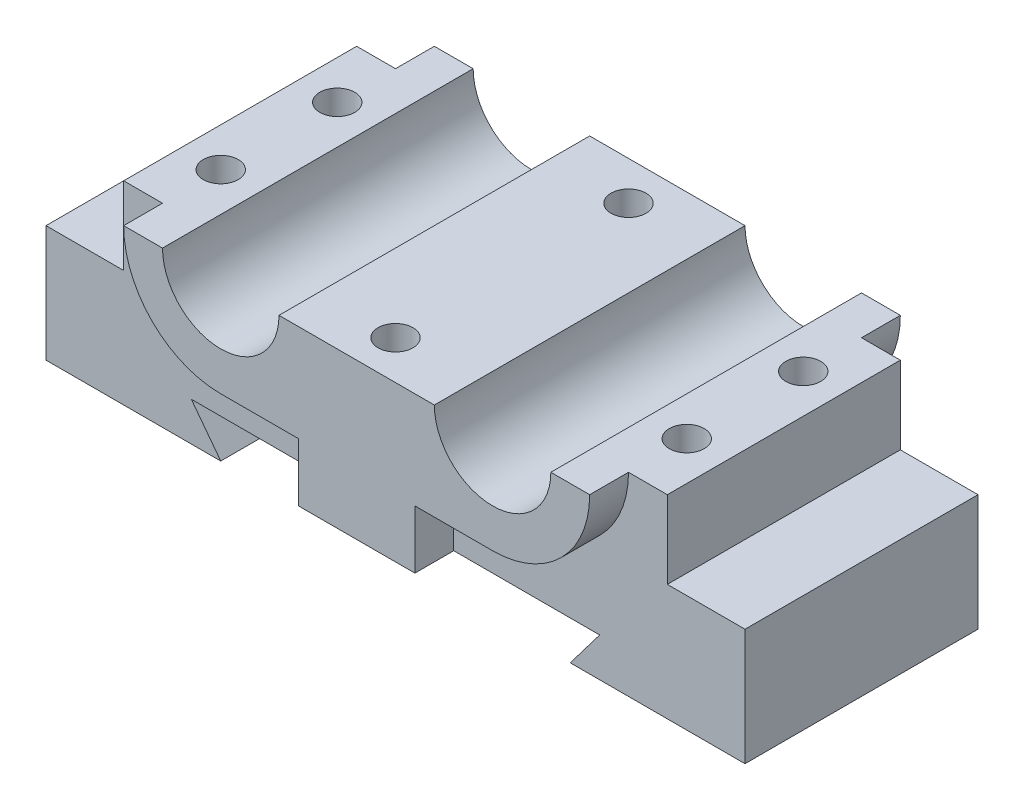
ISO-10303-21;
HEADER;
FILE_DESCRIPTION(('STEP AP214'),'2;1');
FILE_NAME('part.step','',(''),(''),'','','');
FILE_SCHEMA(('AUTOMOTIVE_DESIGN { 1 0 10303 214 1 1 1 1 }'));
ENDSEC;
DATA;
#1=APPLICATION_CONTEXT('core data for automotive mechanical design processes');
#2=APPLICATION_PROTOCOL_DEFINITION('international standard','automotive_design',2000,#1);
#3=PRODUCT_CONTEXT('',#1,'mechanical');
#4=PRODUCT('Part','Part','',(#3));
#5=PRODUCT_RELATED_PRODUCT_CATEGORY('part','',(#4));
#6=PRODUCT_DEFINITION_FORMATION('','',#4);
#7=PRODUCT_DEFINITION_CONTEXT('part definition',#1,'design');
#8=PRODUCT_DEFINITION('design','',#6,#7);
#9=PRODUCT_DEFINITION_SHAPE('','',#8);
#10=(LENGTH_UNIT() NAMED_UNIT(*) SI_UNIT(.MILLI.,.METRE.));
#11=(NAMED_UNIT(*) PLANE_ANGLE_UNIT() SI_UNIT($,.RADIAN.));
#12=(NAMED_UNIT(*) SI_UNIT($,.STERADIAN.) SOLID_ANGLE_UNIT());
#13=UNCERTAINTY_MEASURE_WITH_UNIT(LENGTH_MEASURE(1.E-05),#10,'distance_accuracy_value','');
#14=(GEOMETRIC_REPRESENTATION_CONTEXT(3) GLOBAL_UNCERTAINTY_ASSIGNED_CONTEXT((#13)) GLOBAL_UNIT_ASSIGNED_CONTEXT((#10,
#11,#12)) REPRESENTATION_CONTEXT('',''));
#15=CARTESIAN_POINT('',(0.,0.,0.));
#16=DIRECTION('',(0.,0.,1.));
#17=DIRECTION('',(1.,0.,0.));
#18=AXIS2_PLACEMENT_3D('',#15,#16,#17);
#19=CARTESIAN_POINT('',(0.,17.5,0.));
#20=DIRECTION('',(0.,-1.,0.));
#21=DIRECTION('',(0.,0.,-1.));
#22=AXIS2_PLACEMENT_3D('',#19,#20,#21);
#23=PLANE('',#22);
#24=CARTESIAN_POINT('',(30.,17.5,-7.5));
#25=DIRECTION('',(0.,1.,0.));
#26=DIRECTION('',(0.,0.,-1.));
#27=AXIS2_PLACEMENT_3D('',#24,#25,#26);
#28=CIRCLE('',#27,2.25);
#29=CARTESIAN_POINT('',(30.,17.5,-9.74999999999999));
#30=VERTEX_POINT('',#29);
#31=EDGE_CURVE('E551',#30,#30,#28,.T.);
#32=ORIENTED_EDGE('',*,*,#31,.F.);
#33=EDGE_LOOP('',(#32));
#34=FACE_BOUND('',#33,.T.);
#35=CARTESIAN_POINT('',(30.,17.5,7.5));
#36=DIRECTION('',(0.,1.,0.));
#37=DIRECTION('',(0.,0.,1.));
#38=AXIS2_PLACEMENT_3D('',#35,#36,#37);
#39=CIRCLE('',#38,2.25);
#40=CARTESIAN_POINT('',(30.,17.5,9.74999999999999));
#41=VERTEX_POINT('',#40);
#42=EDGE_CURVE('E545',#41,#41,#39,.T.);
#43=ORIENTED_EDGE('',*,*,#42,.F.);
#44=EDGE_LOOP('',(#43));
#45=FACE_BOUND('',#44,.T.);
#46=DIRECTION('',(0.,0.,1.));
#47=VECTOR('',#46,1.);
#48=CARTESIAN_POINT('',(25.,17.5,-20.));
#49=LINE('',#48,#47);
#50=CARTESIAN_POINT('',(25.,17.5,-20.));
#51=VERTEX_POINT('',#50);
#52=CARTESIAN_POINT('',(25.,17.5,20.));
#53=VERTEX_POINT('',#52);
#54=EDGE_CURVE('E349',#51,#53,#49,.T.);
#55=ORIENTED_EDGE('',*,*,#54,.T.);
#56=DIRECTION('',(-1.,0.,0.));
#57=VECTOR('',#56,1.);
#58=CARTESIAN_POINT('',(0.,17.5,20.));
#59=LINE('',#58,#57);
#60=CARTESIAN_POINT('',(30.,17.5,20.));
#61=VERTEX_POINT('',#60);
#62=EDGE_CURVE('E259',#61,#53,#59,.T.);
#63=ORIENTED_EDGE('',*,*,#62,.F.);
#64=DIRECTION('',(0.,0.,1.));
#65=VECTOR('',#64,1.);
#66=CARTESIAN_POINT('',(30.,17.5,-20.));
#67=LINE('',#66,#65);
#68=CARTESIAN_POINT('',(30.,17.5,15.));
#69=VERTEX_POINT('',#68);
#70=EDGE_CURVE('E255',#69,#61,#67,.T.);
#71=ORIENTED_EDGE('',*,*,#70,.F.);
#72=DIRECTION('',(1.,0.,0.));
#73=VECTOR('',#72,1.);
#74=CARTESIAN_POINT('',(-35.,17.5,15.));
#75=LINE('',#74,#73);
#76=CARTESIAN_POINT('',(35.,17.5,15.));
#77=VERTEX_POINT('',#76);
#78=EDGE_CURVE('E404',#69,#77,#75,.T.);
#79=ORIENTED_EDGE('',*,*,#78,.T.);
#80=DIRECTION('',(0.,0.,-1.));
#81=VECTOR('',#80,1.);
#82=CARTESIAN_POINT('',(35.,17.5,15.));
#83=LINE('',#82,#81);
#84=CARTESIAN_POINT('',(35.,17.5,-15.));
#85=VERTEX_POINT('',#84);
#86=EDGE_CURVE('E409',#77,#85,#83,.T.);
#87=ORIENTED_EDGE('',*,*,#86,.T.);
#88=DIRECTION('',(-1.,0.,0.));
#89=VECTOR('',#88,1.);
#90=CARTESIAN_POINT('',(-35.,17.5,-15.));
#91=LINE('',#90,#89);
#92=CARTESIAN_POINT('',(30.,17.5,-15.));
#93=VERTEX_POINT('',#92);
#94=EDGE_CURVE('E412',#85,#93,#91,.T.);
#95=ORIENTED_EDGE('',*,*,#94,.T.);
#96=CARTESIAN_POINT('',(30.,17.5,-20.));
#97=VERTEX_POINT('',#96);
#98=EDGE_CURVE('E56',#97,#93,#67,.T.);
#99=ORIENTED_EDGE('',*,*,#98,.F.);
#100=DIRECTION('',(-1.,0.,0.));
#101=VECTOR('',#100,1.);
#102=CARTESIAN_POINT('',(0.,17.5,-20.));
#103=LINE('',#102,#101);
#104=EDGE_CURVE('E298',#97,#51,#103,.T.);
#105=ORIENTED_EDGE('',*,*,#104,.T.);
#106=EDGE_LOOP('',(#55,#63,#71,#79,#87,#95,#99,#105));
#107=FACE_BOUND('',#106,.T.);
#108=ADVANCED_FACE('F33',(#34,#45,#107),#23,.F.);
#109=CARTESIAN_POINT('',(0.,17.5,15.));
#110=DIRECTION('',(0.,1.,0.));
#111=DIRECTION('',(0.,0.,-1.));
#112=AXIS2_PLACEMENT_3D('',#109,#110,#111);
#113=CIRCLE('',#112,2.25);
#114=CARTESIAN_POINT('',(0.,17.5,12.75));
#115=VERTEX_POINT('',#114);
#116=EDGE_CURVE('E535',#115,#115,#113,.T.);
#117=ORIENTED_EDGE('',*,*,#116,.F.);
#118=EDGE_LOOP('',(#117));
#119=FACE_BOUND('',#118,.T.);
#120=CARTESIAN_POINT('',(0.,17.5,-15.));
#121=DIRECTION('',(0.,1.,0.));
#122=DIRECTION('',(0.,0.,1.));
#123=AXIS2_PLACEMENT_3D('',#120,#121,#122);
#124=CIRCLE('',#123,2.25);
#125=CARTESIAN_POINT('',(0.,17.5,-12.75));
#126=VERTEX_POINT('',#125);
#127=EDGE_CURVE('E268',#126,#126,#124,.T.);
#128=ORIENTED_EDGE('',*,*,#127,.F.);
#129=EDGE_LOOP('',(#128));
#130=FACE_BOUND('',#129,.T.);
#131=CARTESIAN_POINT('',(10.,17.5,20.));
#132=VERTEX_POINT('',#131);
#133=CARTESIAN_POINT('',(-10.,17.5,20.));
#134=VERTEX_POINT('',#133);
#135=EDGE_CURVE('E275',#132,#134,#59,.T.);
#136=ORIENTED_EDGE('',*,*,#135,.F.);
#137=DIRECTION('',(0.,0.,1.));
#138=VECTOR('',#137,1.);
#139=CARTESIAN_POINT('',(10.,17.5,-20.));
#140=LINE('',#139,#138);
#141=CARTESIAN_POINT('',(10.,17.5,-20.));
#142=VERTEX_POINT('',#141);
#143=EDGE_CURVE('E347',#142,#132,#140,.T.);
#144=ORIENTED_EDGE('',*,*,#143,.F.);
#145=CARTESIAN_POINT('',(-10.,17.5,-20.));
#146=VERTEX_POINT('',#145);
#147=EDGE_CURVE('E303',#142,#146,#103,.T.);
#148=ORIENTED_EDGE('',*,*,#147,.T.);
#149=DIRECTION('',(0.,0.,1.));
#150=VECTOR('',#149,1.);
#151=CARTESIAN_POINT('',(-10.,17.5,-20.));
#152=LINE('',#151,#150);
#153=EDGE_CURVE('E345',#146,#134,#152,.T.);
#154=ORIENTED_EDGE('',*,*,#153,.T.);
#155=EDGE_LOOP('',(#136,#144,#148,#154));
#156=FACE_BOUND('',#155,.T.);
#157=ADVANCED_FACE('F452',(#119,#130,#156),#23,.F.);
#158=CARTESIAN_POINT('',(-45.,7.5,-15.));
#159=DIRECTION('',(0.,0.,1.));
#160=DIRECTION('',(1.,0.,0.));
#161=AXIS2_PLACEMENT_3D('',#158,#159,#160);
#162=PLANE('',#161);
#163=DIRECTION('',(0.,1.,0.));
#164=VECTOR('',#163,1.);
#165=CARTESIAN_POINT('',(-7.50000000000001,7.5,-15.));
#166=LINE('',#165,#164);
#167=CARTESIAN_POINT('',(-7.50000000000001,-2.49999999999994,-15.));
#168=VERTEX_POINT('',#167);
#169=CARTESIAN_POINT('',(-7.50000000000001,5.,-15.));
#170=VERTEX_POINT('',#169);
#171=EDGE_CURVE('E354',#168,#170,#166,.T.);
#172=ORIENTED_EDGE('',*,*,#171,.F.);
#173=DIRECTION('',(-1.,0.,0.));
#174=VECTOR('',#173,1.);
#175=CARTESIAN_POINT('',(-45.,-2.49999999999988,-15.));
#176=LINE('',#175,#174);
#177=CARTESIAN_POINT('',(-26.2867829160891,-2.49999999999991,-15.));
#178=VERTEX_POINT('',#177);
#179=EDGE_CURVE('E396',#168,#178,#176,.T.);
#180=ORIENTED_EDGE('',*,*,#179,.T.);
#181=DIRECTION('',(0.603746672382739,-0.797176238724392,0.));
#182=VECTOR('',#181,1.);
#183=CARTESIAN_POINT('',(-37.9208635207843,12.8614306160315,-15.));
#184=LINE('',#183,#182);
#185=CARTESIAN_POINT('',(-22.5,-7.49999999999992,-15.));
#186=VERTEX_POINT('',#185);
#187=EDGE_CURVE('E393',#178,#186,#184,.T.);
#188=ORIENTED_EDGE('',*,*,#187,.T.);
#189=DIRECTION('',(-1.,0.,0.));
#190=VECTOR('',#189,1.);
#191=CARTESIAN_POINT('',(-45.,-7.5,-15.));
#192=LINE('',#191,#190);
#193=CARTESIAN_POINT('',(-45.,-7.5,-15.));
#194=VERTEX_POINT('',#193);
#195=EDGE_CURVE('E665',#186,#194,#192,.T.);
#196=ORIENTED_EDGE('',*,*,#195,.T.);
#197=DIRECTION('',(0.,-1.,0.));
#198=VECTOR('',#197,1.);
#199=CARTESIAN_POINT('',(-45.,7.5,-15.));
#200=LINE('',#199,#198);
#201=CARTESIAN_POINT('',(-45.,7.5,-15.));
#202=VERTEX_POINT('',#201);
#203=EDGE_CURVE('E691',#202,#194,#200,.T.);
#204=ORIENTED_EDGE('',*,*,#203,.F.);
#205=DIRECTION('',(-1.,0.,0.));
#206=VECTOR('',#205,1.);
#207=CARTESIAN_POINT('',(-45.,7.5,-15.));
#208=LINE('',#207,#206);
#209=CARTESIAN_POINT('',(-35.,7.5,-15.));
#210=VERTEX_POINT('',#209);
#211=EDGE_CURVE('E700',#210,#202,#208,.T.);
#212=ORIENTED_EDGE('',*,*,#211,.F.);
#213=DIRECTION('',(0.,-1.,0.));
#214=VECTOR('',#213,1.);
#215=CARTESIAN_POINT('',(-35.,17.5,-15.));
#216=LINE('',#215,#214);
#217=CARTESIAN_POINT('',(-35.,17.5,-15.));
#218=VERTEX_POINT('',#217);
#219=EDGE_CURVE('E415',#218,#210,#216,.T.);
#220=ORIENTED_EDGE('',*,*,#219,.F.);
#221=CARTESIAN_POINT('',(-30.,17.5,-15.));
#222=VERTEX_POINT('',#221);
#223=EDGE_CURVE('E411',#222,#218,#91,.T.);
#224=ORIENTED_EDGE('',*,*,#223,.F.);
#225=CARTESIAN_POINT('',(-17.5,17.5,-15.));
#226=DIRECTION('',(0.,0.,1.));
#227=DIRECTION('',(1.,0.,0.));
#228=AXIS2_PLACEMENT_3D('',#225,#226,#227);
#229=CIRCLE('',#228,12.5);
#230=CARTESIAN_POINT('',(-17.5,5.,-15.));
#231=VERTEX_POINT('',#230);
#232=EDGE_CURVE('E367',#222,#231,#229,.T.);
#233=ORIENTED_EDGE('',*,*,#232,.T.);
#234=DIRECTION('',(1.,0.,0.));
#235=VECTOR('',#234,1.);
#236=CARTESIAN_POINT('',(-45.,5.,-15.));
#237=LINE('',#236,#235);
#238=EDGE_CURVE('E370',#231,#170,#237,.T.);
#239=ORIENTED_EDGE('',*,*,#238,.T.);
#240=EDGE_LOOP('',(#172,#180,#188,#196,#204,#212,#220,#224,#233,#239));
#241=FACE_BOUND('',#240,.T.);
#242=ADVANCED_FACE('F504',(#241),#162,.F.);
#243=DIRECTION('',(0.,-1.,0.));
#244=VECTOR('',#243,1.);
#245=CARTESIAN_POINT('',(7.49999999999999,7.5,-15.));
#246=LINE('',#245,#244);
#247=CARTESIAN_POINT('',(7.49999999999999,5.,-15.));
#248=VERTEX_POINT('',#247);
#249=CARTESIAN_POINT('',(7.49999999999999,-2.49999999999997,-15.));
#250=VERTEX_POINT('',#249);
#251=EDGE_CURVE('E358',#248,#250,#246,.T.);
#252=ORIENTED_EDGE('',*,*,#251,.F.);
#253=DIRECTION('',(1.,0.,0.));
#254=VECTOR('',#253,1.);
#255=CARTESIAN_POINT('',(-45.,5.,-15.));
#256=LINE('',#255,#254);
#257=CARTESIAN_POINT('',(17.5,5.,-15.));
#258=VERTEX_POINT('',#257);
#259=EDGE_CURVE('E373',#248,#258,#256,.T.);
#260=ORIENTED_EDGE('',*,*,#259,.T.);
#261=CARTESIAN_POINT('',(17.5,17.5,-15.));
#262=DIRECTION('',(0.,0.,1.));
#263=DIRECTION('',(1.,0.,0.));
#264=AXIS2_PLACEMENT_3D('',#261,#262,#263);
#265=CIRCLE('',#264,12.5);
#266=EDGE_CURVE('E362',#258,#93,#265,.T.);
#267=ORIENTED_EDGE('',*,*,#266,.T.);
#268=ORIENTED_EDGE('',*,*,#94,.F.);
#269=DIRECTION('',(0.,-1.,0.));
#270=VECTOR('',#269,1.);
#271=CARTESIAN_POINT('',(35.,17.5,-15.));
#272=LINE('',#271,#270);
#273=CARTESIAN_POINT('',(35.,7.5,-15.));
#274=VERTEX_POINT('',#273);
#275=EDGE_CURVE('E428',#85,#274,#272,.T.);
#276=ORIENTED_EDGE('',*,*,#275,.T.);
#277=CARTESIAN_POINT('',(45.,7.5,-15.));
#278=VERTEX_POINT('',#277);
#279=EDGE_CURVE('E696',#278,#274,#208,.T.);
#280=ORIENTED_EDGE('',*,*,#279,.F.);
#281=DIRECTION('',(0.,-1.,0.));
#282=VECTOR('',#281,1.);
#283=CARTESIAN_POINT('',(45.,7.5,-15.));
#284=LINE('',#283,#282);
#285=CARTESIAN_POINT('',(45.,-7.5,-15.));
#286=VERTEX_POINT('',#285);
#287=EDGE_CURVE('E434',#278,#286,#284,.T.);
#288=ORIENTED_EDGE('',*,*,#287,.T.);
#289=CARTESIAN_POINT('',(22.5,-7.5,-15.));
#290=VERTEX_POINT('',#289);
#291=EDGE_CURVE('E671',#286,#290,#192,.T.);
#292=ORIENTED_EDGE('',*,*,#291,.T.);
#293=DIRECTION('',(0.603746672382742,0.797176238724391,0.));
#294=VECTOR('',#293,1.);
#295=CARTESIAN_POINT('',(5.11495952359333,-30.4548945128882,-15.));
#296=LINE('',#295,#294);
#297=CARTESIAN_POINT('',(26.2867829160891,-2.5,-15.));
#298=VERTEX_POINT('',#297);
#299=EDGE_CURVE('E389',#290,#298,#296,.T.);
#300=ORIENTED_EDGE('',*,*,#299,.T.);
#301=EDGE_CURVE('E397',#298,#250,#176,.T.);
#302=ORIENTED_EDGE('',*,*,#301,.T.);
#303=EDGE_LOOP('',(#252,#260,#267,#268,#276,#280,#288,#292,#300,#302));
#304=FACE_BOUND('',#303,.T.);
#305=ADVANCED_FACE('F645',(#304),#162,.F.);
#306=CARTESIAN_POINT('',(-45.,7.5,15.));
#307=DIRECTION('',(0.,0.,-1.));
#308=DIRECTION('',(-1.,0.,0.));
#309=AXIS2_PLACEMENT_3D('',#306,#307,#308);
#310=PLANE('',#309);
#311=DIRECTION('',(0.,-1.,0.));
#312=VECTOR('',#311,1.);
#313=CARTESIAN_POINT('',(-7.50000000000001,7.5,15.));
#314=LINE('',#313,#312);
#315=CARTESIAN_POINT('',(-7.50000000000001,5.,15.));
#316=VERTEX_POINT('',#315);
#317=CARTESIAN_POINT('',(-7.50000000000001,-2.49999999999994,15.));
#318=VERTEX_POINT('',#317);
#319=EDGE_CURVE('E322',#316,#318,#314,.T.);
#320=ORIENTED_EDGE('',*,*,#319,.F.);
#321=DIRECTION('',(-1.,0.,0.));
#322=VECTOR('',#321,1.);
#323=CARTESIAN_POINT('',(-45.,5.,15.));
#324=LINE('',#323,#322);
#325=CARTESIAN_POINT('',(-17.5,5.,15.));
#326=VERTEX_POINT('',#325);
#327=EDGE_CURVE('E11',#316,#326,#324,.T.);
#328=ORIENTED_EDGE('',*,*,#327,.T.);
#329=CARTESIAN_POINT('',(-17.5,17.5,15.));
#330=DIRECTION('',(0.,0.,-1.));
#331=DIRECTION('',(-1.,0.,0.));
#332=AXIS2_PLACEMENT_3D('',#329,#330,#331);
#333=CIRCLE('',#332,12.5);
#334=CARTESIAN_POINT('',(-30.,17.5,15.));
#335=VERTEX_POINT('',#334);
#336=EDGE_CURVE('E364',#326,#335,#333,.T.);
#337=ORIENTED_EDGE('',*,*,#336,.T.);
#338=CARTESIAN_POINT('',(-35.,17.5,15.));
#339=VERTEX_POINT('',#338);
#340=EDGE_CURVE('E406',#339,#335,#75,.T.);
#341=ORIENTED_EDGE('',*,*,#340,.F.);
#342=DIRECTION('',(0.,-1.,0.));
#343=VECTOR('',#342,1.);
#344=CARTESIAN_POINT('',(-35.,17.5,15.));
#345=LINE('',#344,#343);
#346=CARTESIAN_POINT('',(-35.,7.5,15.));
#347=VERTEX_POINT('',#346);
#348=EDGE_CURVE('E653',#339,#347,#345,.T.);
#349=ORIENTED_EDGE('',*,*,#348,.T.);
#350=DIRECTION('',(1.,0.,0.));
#351=VECTOR('',#350,1.);
#352=CARTESIAN_POINT('',(-45.,7.5,15.));
#353=LINE('',#352,#351);
#354=CARTESIAN_POINT('',(-45.,7.5,15.));
#355=VERTEX_POINT('',#354);
#356=EDGE_CURVE('E688',#355,#347,#353,.T.);
#357=ORIENTED_EDGE('',*,*,#356,.F.);
#358=DIRECTION('',(0.,-1.,0.));
#359=VECTOR('',#358,1.);
#360=CARTESIAN_POINT('',(-45.,7.5,15.));
#361=LINE('',#360,#359);
#362=CARTESIAN_POINT('',(-45.,-7.5,15.));
#363=VERTEX_POINT('',#362);
#364=EDGE_CURVE('E687',#355,#363,#361,.T.);
#365=ORIENTED_EDGE('',*,*,#364,.T.);
#366=DIRECTION('',(1.,0.,0.));
#367=VECTOR('',#366,1.);
#368=CARTESIAN_POINT('',(-45.,-7.5,15.));
#369=LINE('',#368,#367);
#370=CARTESIAN_POINT('',(-22.5,-7.49999999999992,15.));
#371=VERTEX_POINT('',#370);
#372=EDGE_CURVE('E681',#363,#371,#369,.T.);
#373=ORIENTED_EDGE('',*,*,#372,.T.);
#374=DIRECTION('',(0.603746672382739,-0.797176238724392,0.));
#375=VECTOR('',#374,1.);
#376=CARTESIAN_POINT('',(-22.5,-7.49999999999992,15.));
#377=LINE('',#376,#375);
#378=CARTESIAN_POINT('',(-26.2867829160891,-2.49999999999991,15.));
#379=VERTEX_POINT('',#378);
#380=EDGE_CURVE('E383',#379,#371,#377,.T.);
#381=ORIENTED_EDGE('',*,*,#380,.F.);
#382=DIRECTION('',(-1.,0.,0.));
#383=VECTOR('',#382,1.);
#384=CARTESIAN_POINT('',(-26.2867829160891,-2.49999999999991,15.));
#385=LINE('',#384,#383);
#386=EDGE_CURVE('E379',#318,#379,#385,.T.);
#387=ORIENTED_EDGE('',*,*,#386,.F.);
#388=EDGE_LOOP('',(#320,#328,#337,#341,#349,#357,#365,#373,#381,#387));
#389=FACE_BOUND('',#388,.T.);
#390=ADVANCED_FACE('F468',(#389),#310,.F.);
#391=DIRECTION('',(0.,1.,0.));
#392=VECTOR('',#391,1.);
#393=CARTESIAN_POINT('',(7.49999999999999,7.5,15.));
#394=LINE('',#393,#392);
#395=CARTESIAN_POINT('',(7.49999999999999,-2.49999999999997,15.));
#396=VERTEX_POINT('',#395);
#397=CARTESIAN_POINT('',(7.49999999999999,5.,15.));
#398=VERTEX_POINT('',#397);
#399=EDGE_CURVE('E356',#396,#398,#394,.T.);
#400=ORIENTED_EDGE('',*,*,#399,.F.);
#401=CARTESIAN_POINT('',(26.2867829160891,-2.5,15.));
#402=VERTEX_POINT('',#401);
#403=EDGE_CURVE('E380',#402,#396,#385,.T.);
#404=ORIENTED_EDGE('',*,*,#403,.F.);
#405=DIRECTION('',(0.603746672382742,0.79717623872439,0.));
#406=VECTOR('',#405,1.);
#407=CARTESIAN_POINT('',(22.5,-7.5,15.));
#408=LINE('',#407,#406);
#409=CARTESIAN_POINT('',(22.5,-7.5,15.));
#410=VERTEX_POINT('',#409);
#411=EDGE_CURVE('E376',#410,#402,#408,.T.);
#412=ORIENTED_EDGE('',*,*,#411,.F.);
#413=CARTESIAN_POINT('',(45.,-7.5,15.));
#414=VERTEX_POINT('',#413);
#415=EDGE_CURVE('E680',#410,#414,#369,.T.);
#416=ORIENTED_EDGE('',*,*,#415,.T.);
#417=DIRECTION('',(0.,-1.,0.));
#418=VECTOR('',#417,1.);
#419=CARTESIAN_POINT('',(45.,7.5,15.));
#420=LINE('',#419,#418);
#421=CARTESIAN_POINT('',(45.,7.5,15.));
#422=VERTEX_POINT('',#421);
#423=EDGE_CURVE('E685',#422,#414,#420,.T.);
#424=ORIENTED_EDGE('',*,*,#423,.F.);
#425=CARTESIAN_POINT('',(35.,7.5,15.));
#426=VERTEX_POINT('',#425);
#427=EDGE_CURVE('E704',#426,#422,#353,.T.);
#428=ORIENTED_EDGE('',*,*,#427,.F.);
#429=DIRECTION('',(0.,-1.,0.));
#430=VECTOR('',#429,1.);
#431=CARTESIAN_POINT('',(35.,17.5,15.));
#432=LINE('',#431,#430);
#433=EDGE_CURVE('E651',#77,#426,#432,.T.);
#434=ORIENTED_EDGE('',*,*,#433,.F.);
#435=ORIENTED_EDGE('',*,*,#78,.F.);
#436=CARTESIAN_POINT('',(17.5,17.5,15.));
#437=DIRECTION('',(0.,0.,-1.));
#438=DIRECTION('',(-1.,0.,0.));
#439=AXIS2_PLACEMENT_3D('',#436,#437,#438);
#440=CIRCLE('',#439,12.5);
#441=CARTESIAN_POINT('',(17.5,5.,15.));
#442=VERTEX_POINT('',#441);
#443=EDGE_CURVE('E360',#69,#442,#440,.T.);
#444=ORIENTED_EDGE('',*,*,#443,.T.);
#445=DIRECTION('',(-1.,0.,0.));
#446=VECTOR('',#445,1.);
#447=CARTESIAN_POINT('',(-45.,5.,15.));
#448=LINE('',#447,#446);
#449=EDGE_CURVE('E41',#442,#398,#448,.T.);
#450=ORIENTED_EDGE('',*,*,#449,.T.);
#451=EDGE_LOOP('',(#400,#404,#412,#416,#424,#428,#434,#435,#444,#450));
#452=FACE_BOUND('',#451,.T.);
#453=ADVANCED_FACE('F437',(#452),#310,.F.);
#454=CARTESIAN_POINT('',(0.,-7.5,0.));
#455=DIRECTION('',(0.,-1.,0.));
#456=DIRECTION('',(0.,0.,-1.));
#457=AXIS2_PLACEMENT_3D('',#454,#455,#456);
#458=PLANE('',#457);
#459=DIRECTION('',(0.,0.,-1.));
#460=VECTOR('',#459,1.);
#461=CARTESIAN_POINT('',(-22.5,-7.5,0.));
#462=LINE('',#461,#460);
#463=EDGE_CURVE('E433',#371,#186,#462,.T.);
#464=ORIENTED_EDGE('',*,*,#463,.F.);
#465=ORIENTED_EDGE('',*,*,#372,.F.);
#466=DIRECTION('',(0.,0.,1.));
#467=VECTOR('',#466,1.);
#468=CARTESIAN_POINT('',(-45.,-7.5,15.));
#469=LINE('',#468,#467);
#470=EDGE_CURVE('E678',#194,#363,#469,.T.);
#471=ORIENTED_EDGE('',*,*,#470,.F.);
#472=ORIENTED_EDGE('',*,*,#195,.F.);
#473=EDGE_LOOP('',(#464,#465,#471,#472));
#474=FACE_BOUND('',#473,.T.);
#475=ADVANCED_FACE('F718',(#474),#458,.T.);
#476=CARTESIAN_POINT('',(0.,7.5,0.));
#477=DIRECTION('',(0.,-1.,0.));
#478=DIRECTION('',(0.,0.,-1.));
#479=AXIS2_PLACEMENT_3D('',#476,#477,#478);
#480=PLANE('',#479);
#481=DIRECTION('',(0.,0.,1.));
#482=VECTOR('',#481,1.);
#483=CARTESIAN_POINT('',(-35.,7.5,15.));
#484=LINE('',#483,#482);
#485=EDGE_CURVE('E400',#210,#347,#484,.T.);
#486=ORIENTED_EDGE('',*,*,#485,.F.);
#487=ORIENTED_EDGE('',*,*,#211,.T.);
#488=DIRECTION('',(0.,0.,1.));
#489=VECTOR('',#488,1.);
#490=CARTESIAN_POINT('',(-45.,7.5,15.));
#491=LINE('',#490,#489);
#492=EDGE_CURVE('E699',#202,#355,#491,.T.);
#493=ORIENTED_EDGE('',*,*,#492,.T.);
#494=ORIENTED_EDGE('',*,*,#356,.T.);
#495=EDGE_LOOP('',(#486,#487,#493,#494));
#496=FACE_BOUND('',#495,.T.);
#497=ADVANCED_FACE('F712',(#496),#480,.F.);
#498=DIRECTION('',(0.,0.,-1.));
#499=VECTOR('',#498,1.);
#500=CARTESIAN_POINT('',(35.,7.5,15.));
#501=LINE('',#500,#499);
#502=EDGE_CURVE('E405',#426,#274,#501,.T.);
#503=ORIENTED_EDGE('',*,*,#502,.F.);
#504=ORIENTED_EDGE('',*,*,#427,.T.);
#505=DIRECTION('',(0.,0.,-1.));
#506=VECTOR('',#505,1.);
#507=CARTESIAN_POINT('',(45.,7.5,15.));
#508=LINE('',#507,#506);
#509=EDGE_CURVE('E684',#422,#278,#508,.T.);
#510=ORIENTED_EDGE('',*,*,#509,.T.);
#511=ORIENTED_EDGE('',*,*,#279,.T.);
#512=EDGE_LOOP('',(#503,#504,#510,#511));
#513=FACE_BOUND('',#512,.T.);
#514=ADVANCED_FACE('F733',(#513),#480,.F.);
#515=CARTESIAN_POINT('',(45.,7.5,15.));
#516=DIRECTION('',(-1.,0.,0.));
#517=DIRECTION('',(0.,0.,1.));
#518=AXIS2_PLACEMENT_3D('',#515,#516,#517);
#519=PLANE('',#518);
#520=DIRECTION('',(0.,0.,-1.));
#521=VECTOR('',#520,1.);
#522=CARTESIAN_POINT('',(45.,-7.5,15.));
#523=LINE('',#522,#521);
#524=EDGE_CURVE('E662',#414,#286,#523,.T.);
#525=ORIENTED_EDGE('',*,*,#524,.T.);
#526=ORIENTED_EDGE('',*,*,#287,.F.);
#527=ORIENTED_EDGE('',*,*,#509,.F.);
#528=ORIENTED_EDGE('',*,*,#423,.T.);
#529=EDGE_LOOP('',(#525,#526,#527,#528));
#530=FACE_BOUND('',#529,.T.);
#531=ADVANCED_FACE('F35',(#530),#519,.F.);
#532=CARTESIAN_POINT('',(-45.,7.5,15.));
#533=DIRECTION('',(1.,0.,0.));
#534=DIRECTION('',(0.,0.,-1.));
#535=AXIS2_PLACEMENT_3D('',#532,#533,#534);
#536=PLANE('',#535);
#537=ORIENTED_EDGE('',*,*,#470,.T.);
#538=ORIENTED_EDGE('',*,*,#364,.F.);
#539=ORIENTED_EDGE('',*,*,#492,.F.);
#540=ORIENTED_EDGE('',*,*,#203,.T.);
#541=EDGE_LOOP('',(#537,#538,#539,#540));
#542=FACE_BOUND('',#541,.T.);
#543=ADVANCED_FACE('F723',(#542),#536,.F.);
#544=DIRECTION('',(0.,0.,1.));
#545=VECTOR('',#544,1.);
#546=CARTESIAN_POINT('',(22.5,-7.5,0.));
#547=LINE('',#546,#545);
#548=EDGE_CURVE('E431',#290,#410,#547,.T.);
#549=ORIENTED_EDGE('',*,*,#548,.F.);
#550=ORIENTED_EDGE('',*,*,#291,.F.);
#551=ORIENTED_EDGE('',*,*,#524,.F.);
#552=ORIENTED_EDGE('',*,*,#415,.F.);
#553=EDGE_LOOP('',(#549,#550,#551,#552));
#554=FACE_BOUND('',#553,.T.);
#555=ADVANCED_FACE('F725',(#554),#458,.T.);
#556=CARTESIAN_POINT('',(-35.,17.5,15.));
#557=DIRECTION('',(1.,0.,0.));
#558=DIRECTION('',(0.,0.,-1.));
#559=AXIS2_PLACEMENT_3D('',#556,#557,#558);
#560=PLANE('',#559);
#561=ORIENTED_EDGE('',*,*,#485,.T.);
#562=ORIENTED_EDGE('',*,*,#348,.F.);
#563=DIRECTION('',(0.,0.,1.));
#564=VECTOR('',#563,1.);
#565=CARTESIAN_POINT('',(-35.,17.5,15.));
#566=LINE('',#565,#564);
#567=EDGE_CURVE('E401',#218,#339,#566,.T.);
#568=ORIENTED_EDGE('',*,*,#567,.F.);
#569=ORIENTED_EDGE('',*,*,#219,.T.);
#570=EDGE_LOOP('',(#561,#562,#568,#569));
#571=FACE_BOUND('',#570,.T.);
#572=ADVANCED_FACE('F519',(#571),#560,.F.);
#573=CARTESIAN_POINT('',(35.,17.5,15.));
#574=DIRECTION('',(-1.,0.,0.));
#575=DIRECTION('',(0.,0.,1.));
#576=AXIS2_PLACEMENT_3D('',#573,#574,#575);
#577=PLANE('',#576);
#578=ORIENTED_EDGE('',*,*,#502,.T.);
#579=ORIENTED_EDGE('',*,*,#275,.F.);
#580=ORIENTED_EDGE('',*,*,#86,.F.);
#581=ORIENTED_EDGE('',*,*,#433,.T.);
#582=EDGE_LOOP('',(#578,#579,#580,#581));
#583=FACE_BOUND('',#582,.T.);
#584=ADVANCED_FACE('F511',(#583),#577,.F.);
#585=CARTESIAN_POINT('',(-30.,17.5,7.5));
#586=DIRECTION('',(0.,1.,0.));
#587=DIRECTION('',(0.,0.,-1.));
#588=AXIS2_PLACEMENT_3D('',#585,#586,#587);
#589=CIRCLE('',#588,2.25);
#590=CARTESIAN_POINT('',(-30.,17.5,5.25));
#591=VERTEX_POINT('',#590);
#592=EDGE_CURVE('E524',#591,#591,#589,.T.);
#593=ORIENTED_EDGE('',*,*,#592,.F.);
#594=EDGE_LOOP('',(#593));
#595=FACE_BOUND('',#594,.T.);
#596=CARTESIAN_POINT('',(-30.,17.5,-7.5));
#597=DIRECTION('',(0.,1.,0.));
#598=DIRECTION('',(0.,0.,1.));
#599=AXIS2_PLACEMENT_3D('',#596,#597,#598);
#600=CIRCLE('',#599,2.25);
#601=CARTESIAN_POINT('',(-30.,17.5,-5.25));
#602=VERTEX_POINT('',#601);
#603=EDGE_CURVE('E527',#602,#602,#600,.T.);
#604=ORIENTED_EDGE('',*,*,#603,.F.);
#605=EDGE_LOOP('',(#604));
#606=FACE_BOUND('',#605,.T.);
#607=CARTESIAN_POINT('',(-25.,17.5,20.));
#608=VERTEX_POINT('',#607);
#609=CARTESIAN_POINT('',(-30.,17.5,20.));
#610=VERTEX_POINT('',#609);
#611=EDGE_CURVE('E274',#608,#610,#59,.T.);
#612=ORIENTED_EDGE('',*,*,#611,.F.);
#613=DIRECTION('',(0.,0.,1.));
#614=VECTOR('',#613,1.);
#615=CARTESIAN_POINT('',(-25.,17.5,-20.));
#616=LINE('',#615,#614);
#617=CARTESIAN_POINT('',(-25.,17.5,-20.));
#618=VERTEX_POINT('',#617);
#619=EDGE_CURVE('E343',#618,#608,#616,.T.);
#620=ORIENTED_EDGE('',*,*,#619,.F.);
#621=CARTESIAN_POINT('',(-30.,17.5,-20.));
#622=VERTEX_POINT('',#621);
#623=EDGE_CURVE('E302',#618,#622,#103,.T.);
#624=ORIENTED_EDGE('',*,*,#623,.T.);
#625=DIRECTION('',(0.,0.,1.));
#626=VECTOR('',#625,1.);
#627=CARTESIAN_POINT('',(-30.,17.5,-20.));
#628=LINE('',#627,#626);
#629=EDGE_CURVE('E339',#622,#222,#628,.T.);
#630=ORIENTED_EDGE('',*,*,#629,.T.);
#631=ORIENTED_EDGE('',*,*,#223,.T.);
#632=ORIENTED_EDGE('',*,*,#567,.T.);
#633=ORIENTED_EDGE('',*,*,#340,.T.);
#634=EDGE_CURVE('E342',#335,#610,#628,.T.);
#635=ORIENTED_EDGE('',*,*,#634,.T.);
#636=EDGE_LOOP('',(#612,#620,#624,#630,#631,#632,#633,#635));
#637=FACE_BOUND('',#636,.T.);
#638=ADVANCED_FACE('F500',(#595,#606,#637),#23,.F.);
#639=CARTESIAN_POINT('',(-26.2867829160891,-2.49999999999991,-15.00005));
#640=DIRECTION('',(0.,1.,0.));
#641=DIRECTION('',(-1.,0.,0.));
#642=AXIS2_PLACEMENT_3D('',#639,#640,#641);
#643=PLANE('',#642);
#644=ORIENTED_EDGE('',*,*,#179,.F.);
#645=DIRECTION('',(0.,0.,1.));
#646=VECTOR('',#645,1.);
#647=CARTESIAN_POINT('',(-7.50000000000001,-2.49999999999994,-20.));
#648=LINE('',#647,#646);
#649=CARTESIAN_POINT('',(-7.50000000000001,-2.49999999999994,-20.));
#650=VERTEX_POINT('',#649);
#651=EDGE_CURVE('E328',#650,#168,#648,.T.);
#652=ORIENTED_EDGE('',*,*,#651,.F.);
#653=DIRECTION('',(1.,0.,0.));
#654=VECTOR('',#653,1.);
#655=CARTESIAN_POINT('',(0.,-2.49999999999996,-20.));
#656=LINE('',#655,#654);
#657=CARTESIAN_POINT('',(7.49999999999999,-2.49999999999997,-20.));
#658=VERTEX_POINT('',#657);
#659=EDGE_CURVE('E315',#650,#658,#656,.T.);
#660=ORIENTED_EDGE('',*,*,#659,.T.);
#661=DIRECTION('',(0.,0.,1.));
#662=VECTOR('',#661,1.);
#663=CARTESIAN_POINT('',(7.49999999999999,-2.49999999999997,-20.));
#664=LINE('',#663,#662);
#665=EDGE_CURVE('E324',#658,#250,#664,.T.);
#666=ORIENTED_EDGE('',*,*,#665,.T.);
#667=ORIENTED_EDGE('',*,*,#301,.F.);
#668=DIRECTION('',(0.,0.,1.));
#669=VECTOR('',#668,1.);
#670=CARTESIAN_POINT('',(26.2867829160891,-2.5,-15.00005));
#671=LINE('',#670,#669);
#672=EDGE_CURVE('E385',#298,#402,#671,.T.);
#673=ORIENTED_EDGE('',*,*,#672,.T.);
#674=ORIENTED_EDGE('',*,*,#403,.T.);
#675=CARTESIAN_POINT('',(7.49999999999999,-2.49999999999997,20.));
#676=VERTEX_POINT('',#675);
#677=EDGE_CURVE('E327',#396,#676,#664,.T.);
#678=ORIENTED_EDGE('',*,*,#677,.T.);
#679=DIRECTION('',(1.,0.,0.));
#680=VECTOR('',#679,1.);
#681=CARTESIAN_POINT('',(0.,-2.49999999999996,20.));
#682=LINE('',#681,#680);
#683=CARTESIAN_POINT('',(-7.50000000000001,-2.49999999999994,20.));
#684=VERTEX_POINT('',#683);
#685=EDGE_CURVE('E290',#684,#676,#682,.T.);
#686=ORIENTED_EDGE('',*,*,#685,.F.);
#687=EDGE_CURVE('E330',#318,#684,#648,.T.);
#688=ORIENTED_EDGE('',*,*,#687,.F.);
#689=ORIENTED_EDGE('',*,*,#386,.T.);
#690=DIRECTION('',(0.,0.,1.));
#691=VECTOR('',#690,1.);
#692=CARTESIAN_POINT('',(-26.2867829160891,-2.49999999999991,-15.00005));
#693=LINE('',#692,#691);
#694=EDGE_CURVE('E386',#178,#379,#693,.T.);
#695=ORIENTED_EDGE('',*,*,#694,.F.);
#696=EDGE_LOOP('',(#644,#652,#660,#666,#667,#673,#674,#678,#686,#688,#689,#695));
#697=FACE_BOUND('',#696,.T.);
#698=ADVANCED_FACE('F477',(#697),#643,.F.);
#699=CARTESIAN_POINT('',(-22.5,-7.49999999999992,-15.00005));
#700=DIRECTION('',(-0.797176238724392,-0.603746672382739,0.));
#701=DIRECTION('',(0.603746672382739,-0.797176238724392,0.));
#702=AXIS2_PLACEMENT_3D('',#699,#700,#701);
#703=PLANE('',#702);
#704=ORIENTED_EDGE('',*,*,#694,.T.);
#705=ORIENTED_EDGE('',*,*,#380,.T.);
#706=ORIENTED_EDGE('',*,*,#463,.T.);
#707=ORIENTED_EDGE('',*,*,#187,.F.);
#708=EDGE_LOOP('',(#704,#705,#706,#707));
#709=FACE_BOUND('',#708,.T.);
#710=ADVANCED_FACE('F517',(#709),#703,.F.);
#711=CARTESIAN_POINT('',(22.5,-7.5,-15.00005));
#712=DIRECTION('',(0.797176238724391,-0.603746672382742,0.));
#713=DIRECTION('',(0.603746672382742,0.797176238724391,0.));
#714=AXIS2_PLACEMENT_3D('',#711,#712,#713);
#715=PLANE('',#714);
#716=ORIENTED_EDGE('',*,*,#548,.T.);
#717=ORIENTED_EDGE('',*,*,#411,.T.);
#718=ORIENTED_EDGE('',*,*,#672,.F.);
#719=ORIENTED_EDGE('',*,*,#299,.F.);
#720=EDGE_LOOP('',(#716,#717,#718,#719));
#721=FACE_BOUND('',#720,.T.);
#722=ADVANCED_FACE('F610',(#721),#715,.F.);
#723=CARTESIAN_POINT('',(0.,0.,20.));
#724=DIRECTION('',(0.,0.,1.));
#725=DIRECTION('',(1.,0.,0.));
#726=AXIS2_PLACEMENT_3D('',#723,#724,#725);
#727=PLANE('',#726);
#728=DIRECTION('',(1.,0.,0.));
#729=VECTOR('',#728,1.);
#730=CARTESIAN_POINT('',(0.,5.,20.));
#731=LINE('',#730,#729);
#732=CARTESIAN_POINT('',(7.49999999999999,5.,20.));
#733=VERTEX_POINT('',#732);
#734=CARTESIAN_POINT('',(17.5,5.,20.));
#735=VERTEX_POINT('',#734);
#736=EDGE_CURVE('E244',#733,#735,#731,.T.);
#737=ORIENTED_EDGE('',*,*,#736,.T.);
#738=CARTESIAN_POINT('',(17.5,17.5,20.));
#739=DIRECTION('',(0.,0.,1.));
#740=DIRECTION('',(1.,0.,0.));
#741=AXIS2_PLACEMENT_3D('',#738,#739,#740);
#742=CIRCLE('',#741,12.5);
#743=EDGE_CURVE('E252',#735,#61,#742,.T.);
#744=ORIENTED_EDGE('',*,*,#743,.T.);
#745=ORIENTED_EDGE('',*,*,#62,.T.);
#746=CARTESIAN_POINT('',(17.5,17.5,20.));
#747=DIRECTION('',(0.,0.,1.));
#748=DIRECTION('',(1.,0.,0.));
#749=AXIS2_PLACEMENT_3D('',#746,#747,#748);
#750=CIRCLE('',#749,7.5);
#751=EDGE_CURVE('E273',#132,#53,#750,.T.);
#752=ORIENTED_EDGE('',*,*,#751,.F.);
#753=ORIENTED_EDGE('',*,*,#135,.T.);
#754=CARTESIAN_POINT('',(-17.5,17.5,20.));
#755=DIRECTION('',(0.,0.,1.));
#756=DIRECTION('',(1.,0.,0.));
#757=AXIS2_PLACEMENT_3D('',#754,#755,#756);
#758=CIRCLE('',#757,7.5);
#759=EDGE_CURVE('E278',#608,#134,#758,.T.);
#760=ORIENTED_EDGE('',*,*,#759,.F.);
#761=ORIENTED_EDGE('',*,*,#611,.T.);
#762=CARTESIAN_POINT('',(-17.5,17.5,20.));
#763=DIRECTION('',(0.,0.,1.));
#764=DIRECTION('',(1.,0.,0.));
#765=AXIS2_PLACEMENT_3D('',#762,#763,#764);
#766=CIRCLE('',#765,12.5);
#767=CARTESIAN_POINT('',(-17.5,5.,20.));
#768=VERTEX_POINT('',#767);
#769=EDGE_CURVE('E281',#610,#768,#766,.T.);
#770=ORIENTED_EDGE('',*,*,#769,.T.);
#771=DIRECTION('',(1.,0.,0.));
#772=VECTOR('',#771,1.);
#773=CARTESIAN_POINT('',(0.,5.,20.));
#774=LINE('',#773,#772);
#775=CARTESIAN_POINT('',(-7.50000000000001,5.,20.));
#776=VERTEX_POINT('',#775);
#777=EDGE_CURVE('E284',#768,#776,#774,.T.);
#778=ORIENTED_EDGE('',*,*,#777,.T.);
#779=DIRECTION('',(0.,1.,0.));
#780=VECTOR('',#779,1.);
#781=CARTESIAN_POINT('',(-7.50000000000001,0.,20.));
#782=LINE('',#781,#780);
#783=EDGE_CURVE('E287',#684,#776,#782,.T.);
#784=ORIENTED_EDGE('',*,*,#783,.F.);
#785=ORIENTED_EDGE('',*,*,#685,.T.);
#786=DIRECTION('',(0.,-1.,0.));
#787=VECTOR('',#786,1.);
#788=CARTESIAN_POINT('',(7.49999999999999,0.,20.));
#789=LINE('',#788,#787);
#790=EDGE_CURVE('E264',#733,#676,#789,.T.);
#791=ORIENTED_EDGE('',*,*,#790,.F.);
#792=EDGE_LOOP('',(#737,#744,#745,#752,#753,#760,#761,#770,#778,#784,#785,#791));
#793=FACE_BOUND('',#792,.T.);
#794=ADVANCED_FACE('F261',(#793),#727,.T.);
#795=CARTESIAN_POINT('',(17.5,17.5,-20.));
#796=DIRECTION('',(0.,0.,1.));
#797=DIRECTION('',(1.,0.,0.));
#798=AXIS2_PLACEMENT_3D('',#795,#796,#797);
#799=CYLINDRICAL_SURFACE('',#798,12.5);
#800=ORIENTED_EDGE('',*,*,#443,.F.);
#801=ORIENTED_EDGE('',*,*,#70,.T.);
#802=ORIENTED_EDGE('',*,*,#743,.F.);
#803=DIRECTION('',(0.,0.,1.));
#804=VECTOR('',#803,1.);
#805=CARTESIAN_POINT('',(17.5,5.,-20.));
#806=LINE('',#805,#804);
#807=EDGE_CURVE('E48',#442,#735,#806,.T.);
#808=ORIENTED_EDGE('',*,*,#807,.F.);
#809=EDGE_LOOP('',(#800,#801,#802,#808));
#810=FACE_BOUND('',#809,.T.);
#811=ADVANCED_FACE('F253',(#810),#799,.T.);
#812=CARTESIAN_POINT('',(-17.5,17.5,-20.));
#813=DIRECTION('',(0.,0.,1.));
#814=DIRECTION('',(1.,0.,0.));
#815=AXIS2_PLACEMENT_3D('',#812,#813,#814);
#816=CYLINDRICAL_SURFACE('',#815,12.5);
#817=ORIENTED_EDGE('',*,*,#336,.F.);
#818=DIRECTION('',(0.,0.,1.));
#819=VECTOR('',#818,1.);
#820=CARTESIAN_POINT('',(-17.5,5.,-20.));
#821=LINE('',#820,#819);
#822=EDGE_CURVE('E338',#326,#768,#821,.T.);
#823=ORIENTED_EDGE('',*,*,#822,.T.);
#824=ORIENTED_EDGE('',*,*,#769,.F.);
#825=ORIENTED_EDGE('',*,*,#634,.F.);
#826=EDGE_LOOP('',(#817,#823,#824,#825));
#827=FACE_BOUND('',#826,.T.);
#828=ADVANCED_FACE('F461',(#827),#816,.T.);
#829=CARTESIAN_POINT('',(0.,5.,-20.));
#830=DIRECTION('',(0.,-1.,0.));
#831=DIRECTION('',(1.,0.,0.));
#832=AXIS2_PLACEMENT_3D('',#829,#830,#831);
#833=PLANE('',#832);
#834=ORIENTED_EDGE('',*,*,#327,.F.);
#835=DIRECTION('',(0.,0.,1.));
#836=VECTOR('',#835,1.);
#837=CARTESIAN_POINT('',(-7.50000000000001,5.,-20.));
#838=LINE('',#837,#836);
#839=EDGE_CURVE('E334',#316,#776,#838,.T.);
#840=ORIENTED_EDGE('',*,*,#839,.T.);
#841=ORIENTED_EDGE('',*,*,#777,.F.);
#842=ORIENTED_EDGE('',*,*,#822,.F.);
#843=EDGE_LOOP('',(#834,#840,#841,#842));
#844=FACE_BOUND('',#843,.T.);
#845=ADVANCED_FACE('F464',(#844),#833,.T.);
#846=CARTESIAN_POINT('',(-7.50000000000001,0.,-20.));
#847=DIRECTION('',(1.,0.,0.));
#848=DIRECTION('',(0.,0.,-1.));
#849=AXIS2_PLACEMENT_3D('',#846,#847,#848);
#850=PLANE('',#849);
#851=ORIENTED_EDGE('',*,*,#839,.F.);
#852=ORIENTED_EDGE('',*,*,#319,.T.);
#853=ORIENTED_EDGE('',*,*,#687,.T.);
#854=ORIENTED_EDGE('',*,*,#783,.T.);
#855=EDGE_LOOP('',(#851,#852,#853,#854));
#856=FACE_BOUND('',#855,.T.);
#857=ADVANCED_FACE('F473',(#856),#850,.F.);
#858=CARTESIAN_POINT('',(7.49999999999999,0.,-20.));
#859=DIRECTION('',(-1.,0.,0.));
#860=DIRECTION('',(0.,0.,1.));
#861=AXIS2_PLACEMENT_3D('',#858,#859,#860);
#862=PLANE('',#861);
#863=ORIENTED_EDGE('',*,*,#677,.F.);
#864=ORIENTED_EDGE('',*,*,#399,.T.);
#865=DIRECTION('',(0.,0.,1.));
#866=VECTOR('',#865,1.);
#867=CARTESIAN_POINT('',(7.49999999999999,5.,-20.));
#868=LINE('',#867,#866);
#869=EDGE_CURVE('E323',#398,#733,#868,.T.);
#870=ORIENTED_EDGE('',*,*,#869,.T.);
#871=ORIENTED_EDGE('',*,*,#790,.T.);
#872=EDGE_LOOP('',(#863,#864,#870,#871));
#873=FACE_BOUND('',#872,.T.);
#874=ADVANCED_FACE('F481',(#873),#862,.F.);
#875=CARTESIAN_POINT('',(0.,5.,-20.));
#876=DIRECTION('',(0.,-1.,0.));
#877=DIRECTION('',(1.,0.,0.));
#878=AXIS2_PLACEMENT_3D('',#875,#876,#877);
#879=PLANE('',#878);
#880=ORIENTED_EDGE('',*,*,#449,.F.);
#881=ORIENTED_EDGE('',*,*,#807,.T.);
#882=ORIENTED_EDGE('',*,*,#736,.F.);
#883=ORIENTED_EDGE('',*,*,#869,.F.);
#884=EDGE_LOOP('',(#880,#881,#882,#883));
#885=FACE_BOUND('',#884,.T.);
#886=ADVANCED_FACE('F241',(#885),#879,.T.);
#887=ORIENTED_EDGE('',*,*,#259,.F.);
#888=CARTESIAN_POINT('',(7.49999999999999,5.,-20.));
#889=VERTEX_POINT('',#888);
#890=EDGE_CURVE('E319',#889,#248,#868,.T.);
#891=ORIENTED_EDGE('',*,*,#890,.F.);
#892=DIRECTION('',(1.,0.,0.));
#893=VECTOR('',#892,1.);
#894=CARTESIAN_POINT('',(0.,5.,-20.));
#895=LINE('',#894,#893);
#896=CARTESIAN_POINT('',(17.5,5.,-20.));
#897=VERTEX_POINT('',#896);
#898=EDGE_CURVE('E293',#889,#897,#895,.T.);
#899=ORIENTED_EDGE('',*,*,#898,.T.);
#900=EDGE_CURVE('E248',#897,#258,#806,.T.);
#901=ORIENTED_EDGE('',*,*,#900,.T.);
#902=EDGE_LOOP('',(#887,#891,#899,#901));
#903=FACE_BOUND('',#902,.T.);
#904=ADVANCED_FACE('F489',(#903),#879,.T.);
#905=ORIENTED_EDGE('',*,*,#238,.F.);
#906=CARTESIAN_POINT('',(-17.5,5.,-20.));
#907=VERTEX_POINT('',#906);
#908=EDGE_CURVE('E335',#907,#231,#821,.T.);
#909=ORIENTED_EDGE('',*,*,#908,.F.);
#910=DIRECTION('',(1.,0.,0.));
#911=VECTOR('',#910,1.);
#912=CARTESIAN_POINT('',(0.,5.,-20.));
#913=LINE('',#912,#911);
#914=CARTESIAN_POINT('',(-7.50000000000001,5.,-20.));
#915=VERTEX_POINT('',#914);
#916=EDGE_CURVE('E310',#907,#915,#913,.T.);
#917=ORIENTED_EDGE('',*,*,#916,.T.);
#918=EDGE_CURVE('E331',#915,#170,#838,.T.);
#919=ORIENTED_EDGE('',*,*,#918,.T.);
#920=EDGE_LOOP('',(#905,#909,#917,#919));
#921=FACE_BOUND('',#920,.T.);
#922=ADVANCED_FACE('F631',(#921),#833,.T.);
#923=ORIENTED_EDGE('',*,*,#232,.F.);
#924=ORIENTED_EDGE('',*,*,#629,.F.);
#925=CARTESIAN_POINT('',(-17.5,17.5,-20.));
#926=DIRECTION('',(0.,0.,1.));
#927=DIRECTION('',(1.,0.,0.));
#928=AXIS2_PLACEMENT_3D('',#925,#926,#927);
#929=CIRCLE('',#928,12.5);
#930=EDGE_CURVE('E307',#622,#907,#929,.T.);
#931=ORIENTED_EDGE('',*,*,#930,.T.);
#932=ORIENTED_EDGE('',*,*,#908,.T.);
#933=EDGE_LOOP('',(#923,#924,#931,#932));
#934=FACE_BOUND('',#933,.T.);
#935=ADVANCED_FACE('F633',(#934),#816,.T.);
#936=CARTESIAN_POINT('',(-17.5,17.5,-20.));
#937=DIRECTION('',(0.,0.,1.));
#938=DIRECTION('',(1.,0.,0.));
#939=AXIS2_PLACEMENT_3D('',#936,#937,#938);
#940=CYLINDRICAL_SURFACE('',#939,7.5);
#941=ORIENTED_EDGE('',*,*,#619,.T.);
#942=ORIENTED_EDGE('',*,*,#759,.T.);
#943=ORIENTED_EDGE('',*,*,#153,.F.);
#944=CARTESIAN_POINT('',(-17.5,17.5,-20.));
#945=DIRECTION('',(0.,0.,1.));
#946=DIRECTION('',(1.,0.,0.));
#947=AXIS2_PLACEMENT_3D('',#944,#945,#946);
#948=CIRCLE('',#947,7.5);
#949=EDGE_CURVE('E305',#618,#146,#948,.T.);
#950=ORIENTED_EDGE('',*,*,#949,.F.);
#951=EDGE_LOOP('',(#941,#942,#943,#950));
#952=FACE_BOUND('',#951,.T.);
#953=ADVANCED_FACE('F889',(#952),#940,.F.);
#954=CARTESIAN_POINT('',(17.5,17.5,-20.));
#955=DIRECTION('',(0.,0.,1.));
#956=DIRECTION('',(1.,0.,0.));
#957=AXIS2_PLACEMENT_3D('',#954,#955,#956);
#958=CYLINDRICAL_SURFACE('',#957,7.5);
#959=ORIENTED_EDGE('',*,*,#143,.T.);
#960=ORIENTED_EDGE('',*,*,#751,.T.);
#961=ORIENTED_EDGE('',*,*,#54,.F.);
#962=CARTESIAN_POINT('',(17.5,17.5,-20.));
#963=DIRECTION('',(0.,0.,1.));
#964=DIRECTION('',(1.,0.,0.));
#965=AXIS2_PLACEMENT_3D('',#962,#963,#964);
#966=CIRCLE('',#965,7.5);
#967=EDGE_CURVE('E301',#142,#51,#966,.T.);
#968=ORIENTED_EDGE('',*,*,#967,.F.);
#969=EDGE_LOOP('',(#959,#960,#961,#968));
#970=FACE_BOUND('',#969,.T.);
#971=ADVANCED_FACE('F446',(#970),#958,.F.);
#972=ORIENTED_EDGE('',*,*,#266,.F.);
#973=ORIENTED_EDGE('',*,*,#900,.F.);
#974=CARTESIAN_POINT('',(17.5,17.5,-20.));
#975=DIRECTION('',(0.,0.,1.));
#976=DIRECTION('',(1.,0.,0.));
#977=AXIS2_PLACEMENT_3D('',#974,#975,#976);
#978=CIRCLE('',#977,12.5);
#979=EDGE_CURVE('E296',#897,#97,#978,.T.);
#980=ORIENTED_EDGE('',*,*,#979,.T.);
#981=ORIENTED_EDGE('',*,*,#98,.T.);
#982=EDGE_LOOP('',(#972,#973,#980,#981));
#983=FACE_BOUND('',#982,.T.);
#984=ADVANCED_FACE('F495',(#983),#799,.T.);
#985=ORIENTED_EDGE('',*,*,#890,.T.);
#986=ORIENTED_EDGE('',*,*,#251,.T.);
#987=ORIENTED_EDGE('',*,*,#665,.F.);
#988=DIRECTION('',(0.,-1.,0.));
#989=VECTOR('',#988,1.);
#990=CARTESIAN_POINT('',(7.49999999999999,0.,-20.));
#991=LINE('',#990,#989);
#992=EDGE_CURVE('E249',#889,#658,#991,.T.);
#993=ORIENTED_EDGE('',*,*,#992,.F.);
#994=EDGE_LOOP('',(#985,#986,#987,#993));
#995=FACE_BOUND('',#994,.T.);
#996=ADVANCED_FACE('F484',(#995),#862,.F.);
#997=ORIENTED_EDGE('',*,*,#651,.T.);
#998=ORIENTED_EDGE('',*,*,#171,.T.);
#999=ORIENTED_EDGE('',*,*,#918,.F.);
#1000=DIRECTION('',(0.,1.,0.));
#1001=VECTOR('',#1000,1.);
#1002=CARTESIAN_POINT('',(-7.50000000000001,0.,-20.));
#1003=LINE('',#1002,#1001);
#1004=EDGE_CURVE('E313',#650,#915,#1003,.T.);
#1005=ORIENTED_EDGE('',*,*,#1004,.F.);
#1006=EDGE_LOOP('',(#997,#998,#999,#1005));
#1007=FACE_BOUND('',#1006,.T.);
#1008=ADVANCED_FACE('F492',(#1007),#850,.F.);
#1009=CARTESIAN_POINT('',(0.,0.,-20.));
#1010=DIRECTION('',(0.,0.,1.));
#1011=DIRECTION('',(1.,0.,0.));
#1012=AXIS2_PLACEMENT_3D('',#1009,#1010,#1011);
#1013=PLANE('',#1012);
#1014=ORIENTED_EDGE('',*,*,#898,.F.);
#1015=ORIENTED_EDGE('',*,*,#992,.T.);
#1016=ORIENTED_EDGE('',*,*,#659,.F.);
#1017=ORIENTED_EDGE('',*,*,#1004,.T.);
#1018=ORIENTED_EDGE('',*,*,#916,.F.);
#1019=ORIENTED_EDGE('',*,*,#930,.F.);
#1020=ORIENTED_EDGE('',*,*,#623,.F.);
#1021=ORIENTED_EDGE('',*,*,#949,.T.);
#1022=ORIENTED_EDGE('',*,*,#147,.F.);
#1023=ORIENTED_EDGE('',*,*,#967,.T.);
#1024=ORIENTED_EDGE('',*,*,#104,.F.);
#1025=ORIENTED_EDGE('',*,*,#979,.F.);
#1026=EDGE_LOOP('',(#1014,#1015,#1016,#1017,#1018,#1019,#1020,#1021,#1022,#1023,#1024,#1025));
#1027=FACE_BOUND('',#1026,.T.);
#1028=ADVANCED_FACE('F607',(#1027),#1013,.F.);
#1029=CARTESIAN_POINT('',(0.,2.5,-15.));
#1030=DIRECTION('',(0.,1.,0.));
#1031=DIRECTION('',(0.,0.,1.));
#1032=AXIS2_PLACEMENT_3D('',#1029,#1030,#1031);
#1033=CYLINDRICAL_SURFACE('',#1032,2.25);
#1034=CARTESIAN_POINT('',(0.,2.5,-15.));
#1035=DIRECTION('',(0.,1.,0.));
#1036=DIRECTION('',(0.,0.,1.));
#1037=AXIS2_PLACEMENT_3D('',#1034,#1035,#1036);
#1038=CIRCLE('',#1037,2.25);
#1039=CARTESIAN_POINT('',(0.,2.5,-12.75));
#1040=VERTEX_POINT('',#1039);
#1041=EDGE_CURVE('E265',#1040,#1040,#1038,.T.);
#1042=ORIENTED_EDGE('',*,*,#1041,.F.);
#1043=EDGE_LOOP('',(#1042));
#1044=FACE_BOUND('',#1043,.T.);
#1045=ORIENTED_EDGE('',*,*,#127,.T.);
#1046=EDGE_LOOP('',(#1045));
#1047=FACE_BOUND('',#1046,.T.);
#1048=ADVANCED_FACE('F603',(#1044,#1047),#1033,.F.);
#1049=CARTESIAN_POINT('',(0.,2.5,-15.));
#1050=DIRECTION('',(0.,1.,0.));
#1051=DIRECTION('',(0.,0.,1.));
#1052=AXIS2_PLACEMENT_3D('',#1049,#1050,#1051);
#1053=PLANE('',#1052);
#1054=ORIENTED_EDGE('',*,*,#1041,.T.);
#1055=EDGE_LOOP('',(#1054));
#1056=FACE_BOUND('',#1055,.T.);
#1057=ADVANCED_FACE('F599',(#1056),#1053,.T.);
#1058=CARTESIAN_POINT('',(-30.,2.5,-7.5));
#1059=DIRECTION('',(0.,1.,0.));
#1060=DIRECTION('',(0.,0.,1.));
#1061=AXIS2_PLACEMENT_3D('',#1058,#1059,#1060);
#1062=CYLINDRICAL_SURFACE('',#1061,2.25);
#1063=CARTESIAN_POINT('',(-30.,2.5,-7.5));
#1064=DIRECTION('',(0.,1.,0.));
#1065=DIRECTION('',(0.,0.,1.));
#1066=AXIS2_PLACEMENT_3D('',#1063,#1064,#1065);
#1067=CIRCLE('',#1066,2.25);
#1068=CARTESIAN_POINT('',(-30.,2.5,-5.25));
#1069=VERTEX_POINT('',#1068);
#1070=EDGE_CURVE('E529',#1069,#1069,#1067,.T.);
#1071=ORIENTED_EDGE('',*,*,#1070,.F.);
#1072=EDGE_LOOP('',(#1071));
#1073=FACE_BOUND('',#1072,.T.);
#1074=ORIENTED_EDGE('',*,*,#603,.T.);
#1075=EDGE_LOOP('',(#1074));
#1076=FACE_BOUND('',#1075,.T.);
#1077=ADVANCED_FACE('F595',(#1073,#1076),#1062,.F.);
#1078=CARTESIAN_POINT('',(-30.,2.5,-7.5));
#1079=DIRECTION('',(0.,1.,0.));
#1080=DIRECTION('',(0.,0.,1.));
#1081=AXIS2_PLACEMENT_3D('',#1078,#1079,#1080);
#1082=PLANE('',#1081);
#1083=ORIENTED_EDGE('',*,*,#1070,.T.);
#1084=EDGE_LOOP('',(#1083));
#1085=FACE_BOUND('',#1084,.T.);
#1086=ADVANCED_FACE('F591',(#1085),#1082,.T.);
#1087=CARTESIAN_POINT('',(0.,2.5,15.));
#1088=DIRECTION('',(0.,1.,0.));
#1089=DIRECTION('',(0.,0.,1.));
#1090=AXIS2_PLACEMENT_3D('',#1087,#1088,#1089);
#1091=CYLINDRICAL_SURFACE('',#1090,2.25);
#1092=CARTESIAN_POINT('',(0.,2.5,15.));
#1093=DIRECTION('',(0.,1.,0.));
#1094=DIRECTION('',(0.,0.,-1.));
#1095=AXIS2_PLACEMENT_3D('',#1092,#1093,#1094);
#1096=CIRCLE('',#1095,2.25);
#1097=CARTESIAN_POINT('',(0.,2.5,12.75));
#1098=VERTEX_POINT('',#1097);
#1099=EDGE_CURVE('E530',#1098,#1098,#1096,.T.);
#1100=ORIENTED_EDGE('',*,*,#1099,.F.);
#1101=EDGE_LOOP('',(#1100));
#1102=FACE_BOUND('',#1101,.T.);
#1103=ORIENTED_EDGE('',*,*,#116,.T.);
#1104=EDGE_LOOP('',(#1103));
#1105=FACE_BOUND('',#1104,.T.);
#1106=ADVANCED_FACE('F587',(#1102,#1105),#1091,.F.);
#1107=CARTESIAN_POINT('',(0.,2.5,15.));
#1108=DIRECTION('',(0.,-1.,0.));
#1109=DIRECTION('',(0.,0.,-1.));
#1110=AXIS2_PLACEMENT_3D('',#1107,#1108,#1109);
#1111=PLANE('',#1110);
#1112=ORIENTED_EDGE('',*,*,#1099,.T.);
#1113=EDGE_LOOP('',(#1112));
#1114=FACE_BOUND('',#1113,.T.);
#1115=ADVANCED_FACE('F583',(#1114),#1111,.F.);
#1116=CARTESIAN_POINT('',(-30.,2.5,7.5));
#1117=DIRECTION('',(0.,1.,0.));
#1118=DIRECTION('',(0.,0.,1.));
#1119=AXIS2_PLACEMENT_3D('',#1116,#1117,#1118);
#1120=CYLINDRICAL_SURFACE('',#1119,2.25);
#1121=CARTESIAN_POINT('',(-30.,2.5,7.5));
#1122=DIRECTION('',(0.,1.,0.));
#1123=DIRECTION('',(0.,0.,-1.));
#1124=AXIS2_PLACEMENT_3D('',#1121,#1122,#1123);
#1125=CIRCLE('',#1124,2.25);
#1126=CARTESIAN_POINT('',(-30.,2.5,5.25));
#1127=VERTEX_POINT('',#1126);
#1128=EDGE_CURVE('E539',#1127,#1127,#1125,.T.);
#1129=ORIENTED_EDGE('',*,*,#1128,.F.);
#1130=EDGE_LOOP('',(#1129));
#1131=FACE_BOUND('',#1130,.T.);
#1132=ORIENTED_EDGE('',*,*,#592,.T.);
#1133=EDGE_LOOP('',(#1132));
#1134=FACE_BOUND('',#1133,.T.);
#1135=ADVANCED_FACE('F579',(#1131,#1134),#1120,.F.);
#1136=CARTESIAN_POINT('',(-30.,2.5,7.5));
#1137=DIRECTION('',(0.,-1.,0.));
#1138=DIRECTION('',(0.,0.,-1.));
#1139=AXIS2_PLACEMENT_3D('',#1136,#1137,#1138);
#1140=PLANE('',#1139);
#1141=ORIENTED_EDGE('',*,*,#1128,.T.);
#1142=EDGE_LOOP('',(#1141));
#1143=FACE_BOUND('',#1142,.T.);
#1144=ADVANCED_FACE('F575',(#1143),#1140,.F.);
#1145=CARTESIAN_POINT('',(30.,2.5,7.5));
#1146=DIRECTION('',(0.,1.,0.));
#1147=DIRECTION('',(0.,0.,1.));
#1148=AXIS2_PLACEMENT_3D('',#1145,#1146,#1147);
#1149=CYLINDRICAL_SURFACE('',#1148,2.25);
#1150=CARTESIAN_POINT('',(30.,2.5,7.5));
#1151=DIRECTION('',(0.,1.,0.));
#1152=DIRECTION('',(0.,0.,1.));
#1153=AXIS2_PLACEMENT_3D('',#1150,#1151,#1152);
#1154=CIRCLE('',#1153,2.25);
#1155=CARTESIAN_POINT('',(30.,2.5,9.74999999999999));
#1156=VERTEX_POINT('',#1155);
#1157=EDGE_CURVE('E542',#1156,#1156,#1154,.T.);
#1158=ORIENTED_EDGE('',*,*,#1157,.F.);
#1159=EDGE_LOOP('',(#1158));
#1160=FACE_BOUND('',#1159,.T.);
#1161=ORIENTED_EDGE('',*,*,#42,.T.);
#1162=EDGE_LOOP('',(#1161));
#1163=FACE_BOUND('',#1162,.T.);
#1164=ADVANCED_FACE('F569',(#1160,#1163),#1149,.F.);
#1165=CARTESIAN_POINT('',(30.,2.5,7.5));
#1166=DIRECTION('',(0.,1.,0.));
#1167=DIRECTION('',(0.,0.,1.));
#1168=AXIS2_PLACEMENT_3D('',#1165,#1166,#1167);
#1169=PLANE('',#1168);
#1170=ORIENTED_EDGE('',*,*,#1157,.T.);
#1171=EDGE_LOOP('',(#1170));
#1172=FACE_BOUND('',#1171,.T.);
#1173=ADVANCED_FACE('F562',(#1172),#1169,.T.);
#1174=CARTESIAN_POINT('',(30.,2.5,-7.5));
#1175=DIRECTION('',(0.,1.,0.));
#1176=DIRECTION('',(0.,0.,1.));
#1177=AXIS2_PLACEMENT_3D('',#1174,#1175,#1176);
#1178=CYLINDRICAL_SURFACE('',#1177,2.25);
#1179=CARTESIAN_POINT('',(30.,2.5,-7.5));
#1180=DIRECTION('',(0.,1.,0.));
#1181=DIRECTION('',(0.,0.,-1.));
#1182=AXIS2_PLACEMENT_3D('',#1179,#1180,#1181);
#1183=CIRCLE('',#1182,2.25);
#1184=CARTESIAN_POINT('',(30.,2.5,-9.74999999999999));
#1185=VERTEX_POINT('',#1184);
#1186=EDGE_CURVE('E548',#1185,#1185,#1183,.T.);
#1187=ORIENTED_EDGE('',*,*,#1186,.F.);
#1188=EDGE_LOOP('',(#1187));
#1189=FACE_BOUND('',#1188,.T.);
#1190=ORIENTED_EDGE('',*,*,#31,.T.);
#1191=EDGE_LOOP('',(#1190));
#1192=FACE_BOUND('',#1191,.T.);
#1193=ADVANCED_FACE('F559',(#1189,#1192),#1178,.F.);
#1194=CARTESIAN_POINT('',(30.,2.5,-7.5));
#1195=DIRECTION('',(0.,-1.,0.));
#1196=DIRECTION('',(0.,0.,-1.));
#1197=AXIS2_PLACEMENT_3D('',#1194,#1195,#1196);
#1198=PLANE('',#1197);
#1199=ORIENTED_EDGE('',*,*,#1186,.T.);
#1200=EDGE_LOOP('',(#1199));
#1201=FACE_BOUND('',#1200,.T.);
#1202=ADVANCED_FACE('F557',(#1201),#1198,.F.);
#1203=CLOSED_SHELL('',(#108,#157,#242,#305,#390,#453,#475,#497,#514,#531,#543,#555,#572,#584,
#638,#698,#710,#722,#794,#811,#828,#845,#857,#874,#886,#904,#922,#935,#953,#971,#984,#996,#1008,
#1028,#1048,#1057,#1077,#1086,#1106,#1115,#1135,#1144,#1164,#1173,#1193,#1202));
#1204=MANIFOLD_SOLID_BREP('B2',#1203);
#1205=ADVANCED_BREP_SHAPE_REPRESENTATION('',(#18,#1204),#14);
#1206=SHAPE_DEFINITION_REPRESENTATION(#9,#1205);
ENDSEC;
END-ISO-10303-21;
